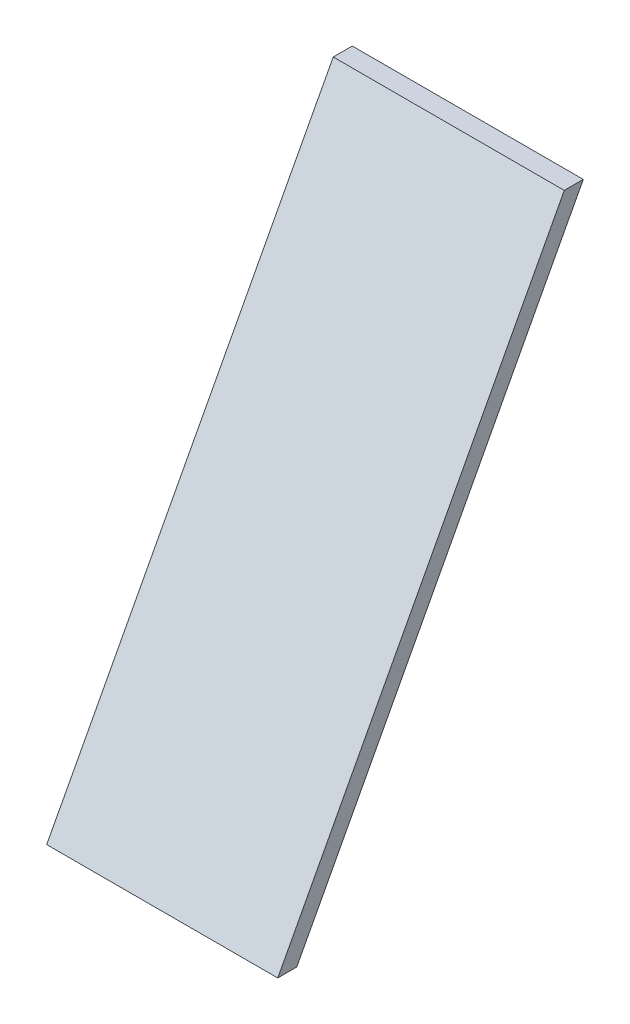
ISO-10303-21;
HEADER;
FILE_DESCRIPTION(('STEP AP214'),'2;1');
FILE_NAME('part.step','',(''),(''),'','','');
FILE_SCHEMA(('AUTOMOTIVE_DESIGN { 1 0 10303 214 1 1 1 1 }'));
ENDSEC;
DATA;
#1=APPLICATION_CONTEXT('core data for automotive mechanical design processes');
#2=APPLICATION_PROTOCOL_DEFINITION('international standard','automotive_design',2000,#1);
#3=PRODUCT_CONTEXT('',#1,'mechanical');
#4=PRODUCT('Part','Part','',(#3));
#5=PRODUCT_RELATED_PRODUCT_CATEGORY('part','',(#4));
#6=PRODUCT_DEFINITION_FORMATION('','',#4);
#7=PRODUCT_DEFINITION_CONTEXT('part definition',#1,'design');
#8=PRODUCT_DEFINITION('design','',#6,#7);
#9=PRODUCT_DEFINITION_SHAPE('','',#8);
#10=(LENGTH_UNIT() NAMED_UNIT(*) SI_UNIT(.MILLI.,.METRE.));
#11=(NAMED_UNIT(*) PLANE_ANGLE_UNIT() SI_UNIT($,.RADIAN.));
#12=(NAMED_UNIT(*) SI_UNIT($,.STERADIAN.) SOLID_ANGLE_UNIT());
#13=UNCERTAINTY_MEASURE_WITH_UNIT(LENGTH_MEASURE(1.E-05),#10,'distance_accuracy_value','');
#14=(GEOMETRIC_REPRESENTATION_CONTEXT(3) GLOBAL_UNCERTAINTY_ASSIGNED_CONTEXT((#13)) GLOBAL_UNIT_ASSIGNED_CONTEXT((#10,
#11,#12)) REPRESENTATION_CONTEXT('',''));
#15=CARTESIAN_POINT('',(0.,0.,0.));
#16=DIRECTION('',(0.,0.,1.));
#17=DIRECTION('',(1.,0.,0.));
#18=AXIS2_PLACEMENT_3D('',#15,#16,#17);
#19=CARTESIAN_POINT('',(43.65,-0.00999999999995449,-170.265974623788));
#20=DIRECTION('',(1.,0.,0.));
#21=DIRECTION('',(0.,0.,1.));
#22=AXIS2_PLACEMENT_3D('',#19,#20,#21);
#23=PLANE('',#22);
#24=DIRECTION('',(0.,-0.882947592858925,0.469471562785895));
#25=VECTOR('',#24,1.);
#26=CARTESIAN_POINT('',(43.65,32.7925886605948,61.6738893611959));
#27=LINE('',#26,#25);
#28=CARTESIAN_POINT('',(43.65,203.6,-29.1460222456487));
#29=VERTEX_POINT('',#28);
#30=CARTESIAN_POINT('',(43.65,0.,79.1100180406296));
#31=VERTEX_POINT('',#30);
#32=EDGE_CURVE('E11',#29,#31,#27,.T.);
#33=ORIENTED_EDGE('',*,*,#32,.F.);
#34=DIRECTION('',(0.,0.,-1.));
#35=VECTOR('',#34,1.);
#36=CARTESIAN_POINT('',(43.65,203.6,-21.9542024237733));
#37=LINE('',#36,#35);
#38=CARTESIAN_POINT('',(43.65,203.6,-21.9542024237733));
#39=VERTEX_POINT('',#38);
#40=EDGE_CURVE('E96',#39,#29,#37,.T.);
#41=ORIENTED_EDGE('',*,*,#40,.F.);
#42=DIRECTION('',(0.,0.882947592858925,-0.469471562785895));
#43=VECTOR('',#42,1.);
#44=CARTESIAN_POINT('',(43.65,0.,86.301837862505));
#45=LINE('',#44,#43);
#46=CARTESIAN_POINT('',(43.65,0.,86.301837862505));
#47=VERTEX_POINT('',#46);
#48=EDGE_CURVE('E99',#47,#39,#45,.T.);
#49=ORIENTED_EDGE('',*,*,#48,.F.);
#50=DIRECTION('',(0.,0.,-1.));
#51=VECTOR('',#50,1.);
#52=CARTESIAN_POINT('',(43.65,0.,-143.164202423773));
#53=LINE('',#52,#51);
#54=EDGE_CURVE('E86',#47,#31,#53,.T.);
#55=ORIENTED_EDGE('',*,*,#54,.T.);
#56=EDGE_LOOP('',(#33,#41,#49,#55));
#57=FACE_BOUND('',#56,.T.);
#58=ADVANCED_FACE('F34',(#57),#23,.T.);
#59=CARTESIAN_POINT('',(-43.65,-0.00999999999995449,-170.265974623788));
#60=DIRECTION('',(-1.,0.,0.));
#61=DIRECTION('',(0.,0.,-1.));
#62=AXIS2_PLACEMENT_3D('',#59,#60,#61);
#63=PLANE('',#62);
#64=DIRECTION('',(0.,-0.882947592858925,0.469471562785895));
#65=VECTOR('',#64,1.);
#66=CARTESIAN_POINT('',(-43.65,32.7925886605948,61.6738893611959));
#67=LINE('',#66,#65);
#68=CARTESIAN_POINT('',(-43.65,203.6,-29.1460222456487));
#69=VERTEX_POINT('',#68);
#70=CARTESIAN_POINT('',(-43.65,0.,79.1100180406296));
#71=VERTEX_POINT('',#70);
#72=EDGE_CURVE('E76',#69,#71,#67,.T.);
#73=ORIENTED_EDGE('',*,*,#72,.T.);
#74=DIRECTION('',(0.,0.,1.));
#75=VECTOR('',#74,1.);
#76=CARTESIAN_POINT('',(-43.65,0.,-143.164202423773));
#77=LINE('',#76,#75);
#78=CARTESIAN_POINT('',(-43.65,0.,86.301837862505));
#79=VERTEX_POINT('',#78);
#80=EDGE_CURVE('E80',#71,#79,#77,.T.);
#81=ORIENTED_EDGE('',*,*,#80,.T.);
#82=DIRECTION('',(0.,-0.882947592858925,0.469471562785895));
#83=VECTOR('',#82,1.);
#84=CARTESIAN_POINT('',(-43.65,0.,86.301837862505));
#85=LINE('',#84,#83);
#86=CARTESIAN_POINT('',(-43.65,203.6,-21.9542024237733));
#87=VERTEX_POINT('',#86);
#88=EDGE_CURVE('E37',#87,#79,#85,.T.);
#89=ORIENTED_EDGE('',*,*,#88,.F.);
#90=DIRECTION('',(0.,0.,1.));
#91=VECTOR('',#90,1.);
#92=CARTESIAN_POINT('',(-43.65,203.6,-21.9542024237733));
#93=LINE('',#92,#91);
#94=EDGE_CURVE('E42',#69,#87,#93,.T.);
#95=ORIENTED_EDGE('',*,*,#94,.F.);
#96=EDGE_LOOP('',(#73,#81,#89,#95));
#97=FACE_BOUND('',#96,.T.);
#98=ADVANCED_FACE('F88',(#97),#63,.T.);
#99=CARTESIAN_POINT('',(-50.,203.6,-21.9542024237733));
#100=DIRECTION('',(0.,-1.,0.));
#101=DIRECTION('',(0.,0.,-1.));
#102=AXIS2_PLACEMENT_3D('',#99,#100,#101);
#103=PLANE('',#102);
#104=ORIENTED_EDGE('',*,*,#40,.T.);
#105=DIRECTION('',(1.,0.,0.));
#106=VECTOR('',#105,1.);
#107=CARTESIAN_POINT('',(-50.,203.6,-29.1460222456487));
#108=LINE('',#107,#106);
#109=EDGE_CURVE('E57',#69,#29,#108,.T.);
#110=ORIENTED_EDGE('',*,*,#109,.F.);
#111=ORIENTED_EDGE('',*,*,#94,.T.);
#112=DIRECTION('',(1.,0.,0.));
#113=VECTOR('',#112,1.);
#114=CARTESIAN_POINT('',(-50.,203.6,-21.9542024237733));
#115=LINE('',#114,#113);
#116=EDGE_CURVE('E94',#87,#39,#115,.T.);
#117=ORIENTED_EDGE('',*,*,#116,.T.);
#118=EDGE_LOOP('',(#104,#110,#111,#117));
#119=FACE_BOUND('',#118,.T.);
#120=ADVANCED_FACE('F107',(#119),#103,.F.);
#121=CARTESIAN_POINT('',(-50.,-2.98114442369041,80.6951206478509));
#122=DIRECTION('',(0.,-0.469471562785895,-0.882947592858925));
#123=DIRECTION('',(0.,0.882947592858925,-0.469471562785895));
#124=AXIS2_PLACEMENT_3D('',#121,#122,#123);
#125=PLANE('',#124);
#126=ORIENTED_EDGE('',*,*,#32,.T.);
#127=DIRECTION('',(1.,0.,0.));
#128=VECTOR('',#127,1.);
#129=CARTESIAN_POINT('',(-50.,0.,79.1100180406296));
#130=LINE('',#129,#128);
#131=EDGE_CURVE('E50',#71,#31,#130,.T.);
#132=ORIENTED_EDGE('',*,*,#131,.F.);
#133=ORIENTED_EDGE('',*,*,#72,.F.);
#134=ORIENTED_EDGE('',*,*,#109,.T.);
#135=EDGE_LOOP('',(#126,#132,#133,#134));
#136=FACE_BOUND('',#135,.T.);
#137=ADVANCED_FACE('F74',(#136),#125,.T.);
#138=CARTESIAN_POINT('',(-50.,0.,86.301837862505));
#139=DIRECTION('',(0.,-0.469471562785895,-0.882947592858925));
#140=DIRECTION('',(0.,0.882947592858925,-0.469471562785895));
#141=AXIS2_PLACEMENT_3D('',#138,#139,#140);
#142=PLANE('',#141);
#143=ORIENTED_EDGE('',*,*,#48,.T.);
#144=ORIENTED_EDGE('',*,*,#116,.F.);
#145=ORIENTED_EDGE('',*,*,#88,.T.);
#146=DIRECTION('',(1.,0.,0.));
#147=VECTOR('',#146,1.);
#148=CARTESIAN_POINT('',(-50.,0.,86.301837862505));
#149=LINE('',#148,#147);
#150=EDGE_CURVE('E82',#79,#47,#149,.T.);
#151=ORIENTED_EDGE('',*,*,#150,.T.);
#152=EDGE_LOOP('',(#143,#144,#145,#151));
#153=FACE_BOUND('',#152,.T.);
#154=ADVANCED_FACE('F104',(#153),#142,.F.);
#155=CARTESIAN_POINT('',(62.575,0.,-143.164202423773));
#156=DIRECTION('',(0.,-1.,0.));
#157=DIRECTION('',(-1.,0.,0.));
#158=AXIS2_PLACEMENT_3D('',#155,#156,#157);
#159=PLANE('',#158);
#160=ORIENTED_EDGE('',*,*,#150,.F.);
#161=ORIENTED_EDGE('',*,*,#80,.F.);
#162=ORIENTED_EDGE('',*,*,#131,.T.);
#163=ORIENTED_EDGE('',*,*,#54,.F.);
#164=EDGE_LOOP('',(#160,#161,#162,#163));
#165=FACE_BOUND('',#164,.T.);
#166=ADVANCED_FACE('F81',(#165),#159,.T.);
#167=CLOSED_SHELL('',(#58,#98,#120,#137,#154,#166));
#168=MANIFOLD_SOLID_BREP('B2',#167);
#169=ADVANCED_BREP_SHAPE_REPRESENTATION('',(#18,#168),#14);
#170=SHAPE_DEFINITION_REPRESENTATION(#9,#169);
ENDSEC;
END-ISO-10303-21;
